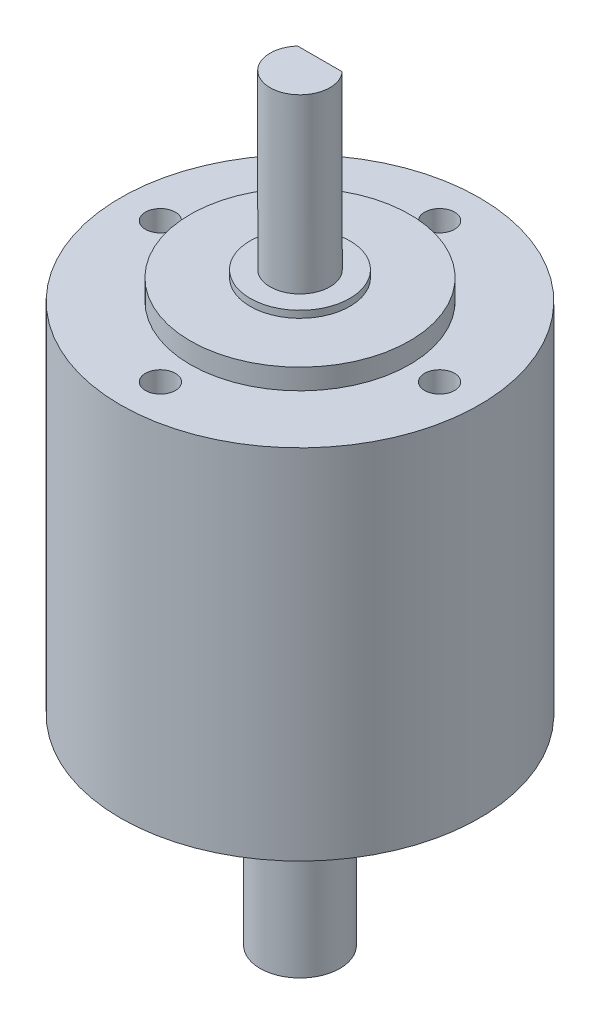
ISO-10303-21;
HEADER;
FILE_DESCRIPTION(('STEP AP214'),'2;1');
FILE_NAME('part.step','',(''),(''),'','','');
FILE_SCHEMA(('AUTOMOTIVE_DESIGN { 1 0 10303 214 1 1 1 1 }'));
ENDSEC;
DATA;
#1=APPLICATION_CONTEXT('core data for automotive mechanical design processes');
#2=APPLICATION_PROTOCOL_DEFINITION('international standard','automotive_design',2000,#1);
#3=PRODUCT_CONTEXT('',#1,'mechanical');
#4=PRODUCT('Part','Part','',(#3));
#5=PRODUCT_RELATED_PRODUCT_CATEGORY('part','',(#4));
#6=PRODUCT_DEFINITION_FORMATION('','',#4);
#7=PRODUCT_DEFINITION_CONTEXT('part definition',#1,'design');
#8=PRODUCT_DEFINITION('design','',#6,#7);
#9=PRODUCT_DEFINITION_SHAPE('','',#8);
#10=(LENGTH_UNIT() NAMED_UNIT(*) SI_UNIT(.MILLI.,.METRE.));
#11=(NAMED_UNIT(*) PLANE_ANGLE_UNIT() SI_UNIT($,.RADIAN.));
#12=(NAMED_UNIT(*) SI_UNIT($,.STERADIAN.) SOLID_ANGLE_UNIT());
#13=UNCERTAINTY_MEASURE_WITH_UNIT(LENGTH_MEASURE(1.E-05),#10,'distance_accuracy_value','');
#14=(GEOMETRIC_REPRESENTATION_CONTEXT(3) GLOBAL_UNCERTAINTY_ASSIGNED_CONTEXT((#13)) GLOBAL_UNIT_ASSIGNED_CONTEXT((#10,
#11,#12)) REPRESENTATION_CONTEXT('',''));
#15=CARTESIAN_POINT('',(0.,0.,0.));
#16=DIRECTION('',(0.,0.,1.));
#17=DIRECTION('',(1.,0.,0.));
#18=AXIS2_PLACEMENT_3D('',#15,#16,#17);
#19=CARTESIAN_POINT('',(0.,17.9451,0.));
#20=DIRECTION('',(0.,-1.,0.));
#21=DIRECTION('',(0.,0.,-1.));
#22=AXIS2_PLACEMENT_3D('',#19,#20,#21);
#23=CYLINDRICAL_SURFACE('',#22,18.);
#24=CARTESIAN_POINT('',(0.,17.9451,0.));
#25=DIRECTION('',(0.,1.,0.));
#26=DIRECTION('',(0.,0.,1.));
#27=AXIS2_PLACEMENT_3D('',#24,#25,#26);
#28=CIRCLE('',#27,18.);
#29=CARTESIAN_POINT('',(0.,17.9451,18.));
#30=VERTEX_POINT('',#29);
#31=EDGE_CURVE('E175',#30,#30,#28,.T.);
#32=ORIENTED_EDGE('',*,*,#31,.F.);
#33=EDGE_LOOP('',(#32));
#34=FACE_BOUND('',#33,.T.);
#35=CARTESIAN_POINT('',(0.,-17.9451,0.));
#36=DIRECTION('',(0.,1.,0.));
#37=DIRECTION('',(0.,0.,1.));
#38=AXIS2_PLACEMENT_3D('',#35,#36,#37);
#39=CIRCLE('',#38,18.);
#40=CARTESIAN_POINT('',(0.,-17.9451,18.));
#41=VERTEX_POINT('',#40);
#42=EDGE_CURVE('E174',#41,#41,#39,.T.);
#43=ORIENTED_EDGE('',*,*,#42,.T.);
#44=EDGE_LOOP('',(#43));
#45=FACE_BOUND('',#44,.T.);
#46=ADVANCED_FACE('F39',(#34,#45),#23,.T.);
#47=CARTESIAN_POINT('',(0.,17.9451,0.));
#48=DIRECTION('',(0.,1.,0.));
#49=DIRECTION('',(0.,0.,1.));
#50=AXIS2_PLACEMENT_3D('',#47,#48,#49);
#51=PLANE('',#50);
#52=CARTESIAN_POINT('',(0.,17.9451,-14.));
#53=DIRECTION('',(0.,1.,0.));
#54=DIRECTION('',(0.,0.,1.));
#55=AXIS2_PLACEMENT_3D('',#52,#53,#54);
#56=CIRCLE('',#55,1.5);
#57=CARTESIAN_POINT('',(0.,17.9451,-12.5));
#58=VERTEX_POINT('',#57);
#59=EDGE_CURVE('E132',#58,#58,#56,.T.);
#60=ORIENTED_EDGE('',*,*,#59,.F.);
#61=EDGE_LOOP('',(#60));
#62=FACE_BOUND('',#61,.T.);
#63=CARTESIAN_POINT('',(-14.,17.9451,0.));
#64=DIRECTION('',(0.,1.,0.));
#65=DIRECTION('',(0.,0.,1.));
#66=AXIS2_PLACEMENT_3D('',#63,#64,#65);
#67=CIRCLE('',#66,1.5);
#68=CARTESIAN_POINT('',(-14.,17.9451,1.5));
#69=VERTEX_POINT('',#68);
#70=EDGE_CURVE('E138',#69,#69,#67,.T.);
#71=ORIENTED_EDGE('',*,*,#70,.F.);
#72=EDGE_LOOP('',(#71));
#73=FACE_BOUND('',#72,.T.);
#74=CARTESIAN_POINT('',(0.,17.9451,14.));
#75=DIRECTION('',(0.,1.,0.));
#76=DIRECTION('',(0.,0.,1.));
#77=AXIS2_PLACEMENT_3D('',#74,#75,#76);
#78=CIRCLE('',#77,1.5);
#79=CARTESIAN_POINT('',(0.,17.9451,15.5));
#80=VERTEX_POINT('',#79);
#81=EDGE_CURVE('E144',#80,#80,#78,.T.);
#82=ORIENTED_EDGE('',*,*,#81,.F.);
#83=EDGE_LOOP('',(#82));
#84=FACE_BOUND('',#83,.T.);
#85=CARTESIAN_POINT('',(14.,17.9451,0.));
#86=DIRECTION('',(0.,1.,0.));
#87=DIRECTION('',(0.,0.,1.));
#88=AXIS2_PLACEMENT_3D('',#85,#86,#87);
#89=CIRCLE('',#88,1.5);
#90=CARTESIAN_POINT('',(14.,17.9451,1.5));
#91=VERTEX_POINT('',#90);
#92=EDGE_CURVE('E107',#91,#91,#89,.T.);
#93=ORIENTED_EDGE('',*,*,#92,.F.);
#94=EDGE_LOOP('',(#93));
#95=FACE_BOUND('',#94,.T.);
#96=CARTESIAN_POINT('',(0.,17.9451,0.));
#97=DIRECTION('',(0.,1.,0.));
#98=DIRECTION('',(0.,0.,1.));
#99=AXIS2_PLACEMENT_3D('',#96,#97,#98);
#100=CIRCLE('',#99,11.);
#101=CARTESIAN_POINT('',(0.,17.9451,11.));
#102=VERTEX_POINT('',#101);
#103=EDGE_CURVE('E169',#102,#102,#100,.F.);
#104=ORIENTED_EDGE('',*,*,#103,.T.);
#105=EDGE_LOOP('',(#104));
#106=FACE_BOUND('',#105,.T.);
#107=ORIENTED_EDGE('',*,*,#31,.T.);
#108=EDGE_LOOP('',(#107));
#109=FACE_BOUND('',#108,.T.);
#110=ADVANCED_FACE('F218',(#62,#73,#84,#95,#106,#109),#51,.T.);
#111=CARTESIAN_POINT('',(0.,-17.9451,0.));
#112=DIRECTION('',(0.,1.,0.));
#113=DIRECTION('',(0.,0.,1.));
#114=AXIS2_PLACEMENT_3D('',#111,#112,#113);
#115=PLANE('',#114);
#116=CARTESIAN_POINT('',(0.,-17.9451,-14.));
#117=DIRECTION('',(0.,1.,0.));
#118=DIRECTION('',(0.,0.,1.));
#119=AXIS2_PLACEMENT_3D('',#116,#117,#118);
#120=CIRCLE('',#119,1.5);
#121=CARTESIAN_POINT('',(0.,-17.9451,-12.5));
#122=VERTEX_POINT('',#121);
#123=EDGE_CURVE('E108',#122,#122,#120,.T.);
#124=ORIENTED_EDGE('',*,*,#123,.T.);
#125=EDGE_LOOP('',(#124));
#126=FACE_BOUND('',#125,.T.);
#127=CARTESIAN_POINT('',(-14.,-17.9451,0.));
#128=DIRECTION('',(0.,1.,0.));
#129=DIRECTION('',(0.,0.,1.));
#130=AXIS2_PLACEMENT_3D('',#127,#128,#129);
#131=CIRCLE('',#130,1.5);
#132=CARTESIAN_POINT('',(-14.,-17.9451,1.5));
#133=VERTEX_POINT('',#132);
#134=EDGE_CURVE('E114',#133,#133,#131,.T.);
#135=ORIENTED_EDGE('',*,*,#134,.T.);
#136=EDGE_LOOP('',(#135));
#137=FACE_BOUND('',#136,.T.);
#138=CARTESIAN_POINT('',(0.,-17.9451,14.));
#139=DIRECTION('',(0.,1.,0.));
#140=DIRECTION('',(0.,0.,1.));
#141=AXIS2_PLACEMENT_3D('',#138,#139,#140);
#142=CIRCLE('',#141,1.5);
#143=CARTESIAN_POINT('',(0.,-17.9451,15.5));
#144=VERTEX_POINT('',#143);
#145=EDGE_CURVE('E120',#144,#144,#142,.T.);
#146=ORIENTED_EDGE('',*,*,#145,.T.);
#147=EDGE_LOOP('',(#146));
#148=FACE_BOUND('',#147,.T.);
#149=CARTESIAN_POINT('',(14.,-17.9451,0.));
#150=DIRECTION('',(0.,1.,0.));
#151=DIRECTION('',(0.,0.,1.));
#152=AXIS2_PLACEMENT_3D('',#149,#150,#151);
#153=CIRCLE('',#152,1.5);
#154=CARTESIAN_POINT('',(14.,-17.9451,1.5));
#155=VERTEX_POINT('',#154);
#156=EDGE_CURVE('E103',#155,#155,#153,.T.);
#157=ORIENTED_EDGE('',*,*,#156,.T.);
#158=EDGE_LOOP('',(#157));
#159=FACE_BOUND('',#158,.T.);
#160=CARTESIAN_POINT('',(0.,-17.9451,0.));
#161=DIRECTION('',(0.,1.,0.));
#162=DIRECTION('',(0.,0.,1.));
#163=AXIS2_PLACEMENT_3D('',#160,#161,#162);
#164=CIRCLE('',#163,11.);
#165=CARTESIAN_POINT('',(0.,-17.9451,11.));
#166=VERTEX_POINT('',#165);
#167=EDGE_CURVE('E178',#166,#166,#164,.F.);
#168=ORIENTED_EDGE('',*,*,#167,.F.);
#169=EDGE_LOOP('',(#168));
#170=FACE_BOUND('',#169,.T.);
#171=ORIENTED_EDGE('',*,*,#42,.F.);
#172=EDGE_LOOP('',(#171));
#173=FACE_BOUND('',#172,.T.);
#174=ADVANCED_FACE('F223',(#126,#137,#148,#159,#170,#173),#115,.F.);
#175=CARTESIAN_POINT('',(0.,-20.0025,0.));
#176=DIRECTION('',(0.,1.,0.));
#177=DIRECTION('',(0.,0.,1.));
#178=AXIS2_PLACEMENT_3D('',#175,#176,#177);
#179=PLANE('',#178);
#180=CARTESIAN_POINT('',(0.,-20.0025,0.));
#181=DIRECTION('',(0.,1.,0.));
#182=DIRECTION('',(0.,0.,1.));
#183=AXIS2_PLACEMENT_3D('',#180,#181,#182);
#184=CIRCLE('',#183,5.);
#185=CARTESIAN_POINT('',(0.,-20.0025,5.));
#186=VERTEX_POINT('',#185);
#187=EDGE_CURVE('E13',#186,#186,#184,.F.);
#188=ORIENTED_EDGE('',*,*,#187,.F.);
#189=EDGE_LOOP('',(#188));
#190=FACE_BOUND('',#189,.T.);
#191=CARTESIAN_POINT('',(0.,-20.0025,0.));
#192=DIRECTION('',(0.,1.,0.));
#193=DIRECTION('',(0.,0.,1.));
#194=AXIS2_PLACEMENT_3D('',#191,#192,#193);
#195=CIRCLE('',#194,11.);
#196=CARTESIAN_POINT('',(0.,-20.0025,11.));
#197=VERTEX_POINT('',#196);
#198=EDGE_CURVE('E165',#197,#197,#195,.T.);
#199=ORIENTED_EDGE('',*,*,#198,.F.);
#200=EDGE_LOOP('',(#199));
#201=FACE_BOUND('',#200,.T.);
#202=ADVANCED_FACE('F231',(#190,#201),#179,.F.);
#203=CARTESIAN_POINT('',(0.,20.0025,0.));
#204=DIRECTION('',(0.,-1.,0.));
#205=DIRECTION('',(0.,0.,-1.));
#206=AXIS2_PLACEMENT_3D('',#203,#204,#205);
#207=CYLINDRICAL_SURFACE('',#206,11.);
#208=ORIENTED_EDGE('',*,*,#198,.T.);
#209=EDGE_LOOP('',(#208));
#210=FACE_BOUND('',#209,.T.);
#211=ORIENTED_EDGE('',*,*,#167,.T.);
#212=EDGE_LOOP('',(#211));
#213=FACE_BOUND('',#212,.T.);
#214=ADVANCED_FACE('F236',(#210,#213),#207,.T.);
#215=ORIENTED_EDGE('',*,*,#103,.F.);
#216=EDGE_LOOP('',(#215));
#217=FACE_BOUND('',#216,.T.);
#218=CARTESIAN_POINT('',(0.,20.0025,0.));
#219=DIRECTION('',(0.,1.,0.));
#220=DIRECTION('',(0.,0.,1.));
#221=AXIS2_PLACEMENT_3D('',#218,#219,#220);
#222=CIRCLE('',#221,11.);
#223=CARTESIAN_POINT('',(0.,20.0025,11.));
#224=VERTEX_POINT('',#223);
#225=EDGE_CURVE('E166',#224,#224,#222,.T.);
#226=ORIENTED_EDGE('',*,*,#225,.F.);
#227=EDGE_LOOP('',(#226));
#228=FACE_BOUND('',#227,.T.);
#229=ADVANCED_FACE('F241',(#217,#228),#207,.T.);
#230=CARTESIAN_POINT('',(0.,20.0025,0.));
#231=DIRECTION('',(0.,1.,0.));
#232=DIRECTION('',(0.,0.,1.));
#233=AXIS2_PLACEMENT_3D('',#230,#231,#232);
#234=PLANE('',#233);
#235=CARTESIAN_POINT('',(0.,20.0025,0.));
#236=DIRECTION('',(0.,1.,0.));
#237=DIRECTION('',(0.,0.,1.));
#238=AXIS2_PLACEMENT_3D('',#235,#236,#237);
#239=CIRCLE('',#238,5.);
#240=CARTESIAN_POINT('',(0.,20.0025,5.));
#241=VERTEX_POINT('',#240);
#242=EDGE_CURVE('E42',#241,#241,#239,.F.);
#243=ORIENTED_EDGE('',*,*,#242,.T.);
#244=EDGE_LOOP('',(#243));
#245=FACE_BOUND('',#244,.T.);
#246=ORIENTED_EDGE('',*,*,#225,.T.);
#247=EDGE_LOOP('',(#246));
#248=FACE_BOUND('',#247,.T.);
#249=ADVANCED_FACE('F243',(#245,#248),#234,.T.);
#250=CARTESIAN_POINT('',(14.,13.9451,0.));
#251=DIRECTION('',(0.,1.,0.));
#252=DIRECTION('',(0.,0.,1.));
#253=AXIS2_PLACEMENT_3D('',#250,#251,#252);
#254=CYLINDRICAL_SURFACE('',#253,1.5);
#255=CARTESIAN_POINT('',(14.,13.9451,0.));
#256=DIRECTION('',(0.,1.,0.));
#257=DIRECTION('',(0.,0.,1.));
#258=AXIS2_PLACEMENT_3D('',#255,#256,#257);
#259=CIRCLE('',#258,1.5);
#260=CARTESIAN_POINT('',(14.,13.9451,1.5));
#261=VERTEX_POINT('',#260);
#262=EDGE_CURVE('E147',#261,#261,#259,.T.);
#263=ORIENTED_EDGE('',*,*,#262,.F.);
#264=EDGE_LOOP('',(#263));
#265=FACE_BOUND('',#264,.T.);
#266=ORIENTED_EDGE('',*,*,#92,.T.);
#267=EDGE_LOOP('',(#266));
#268=FACE_BOUND('',#267,.T.);
#269=ADVANCED_FACE('F248',(#265,#268),#254,.F.);
#270=CARTESIAN_POINT('',(14.,13.9451,0.));
#271=DIRECTION('',(0.,1.,0.));
#272=DIRECTION('',(0.,0.,1.));
#273=AXIS2_PLACEMENT_3D('',#270,#271,#272);
#274=PLANE('',#273);
#275=ORIENTED_EDGE('',*,*,#262,.T.);
#276=EDGE_LOOP('',(#275));
#277=FACE_BOUND('',#276,.T.);
#278=ADVANCED_FACE('F267',(#277),#274,.T.);
#279=CARTESIAN_POINT('',(0.,13.9451,14.));
#280=DIRECTION('',(0.,1.,0.));
#281=DIRECTION('',(0.,0.,1.));
#282=AXIS2_PLACEMENT_3D('',#279,#280,#281);
#283=CYLINDRICAL_SURFACE('',#282,1.5);
#284=CARTESIAN_POINT('',(0.,13.9451,14.));
#285=DIRECTION('',(0.,1.,0.));
#286=DIRECTION('',(0.,0.,1.));
#287=AXIS2_PLACEMENT_3D('',#284,#285,#286);
#288=CIRCLE('',#287,1.5);
#289=CARTESIAN_POINT('',(0.,13.9451,15.5));
#290=VERTEX_POINT('',#289);
#291=EDGE_CURVE('E141',#290,#290,#288,.T.);
#292=ORIENTED_EDGE('',*,*,#291,.F.);
#293=EDGE_LOOP('',(#292));
#294=FACE_BOUND('',#293,.T.);
#295=ORIENTED_EDGE('',*,*,#81,.T.);
#296=EDGE_LOOP('',(#295));
#297=FACE_BOUND('',#296,.T.);
#298=ADVANCED_FACE('F271',(#294,#297),#283,.F.);
#299=CARTESIAN_POINT('',(0.,13.9451,14.));
#300=DIRECTION('',(0.,1.,0.));
#301=DIRECTION('',(0.,0.,1.));
#302=AXIS2_PLACEMENT_3D('',#299,#300,#301);
#303=PLANE('',#302);
#304=ORIENTED_EDGE('',*,*,#291,.T.);
#305=EDGE_LOOP('',(#304));
#306=FACE_BOUND('',#305,.T.);
#307=ADVANCED_FACE('F275',(#306),#303,.T.);
#308=CARTESIAN_POINT('',(-14.,13.9451,0.));
#309=DIRECTION('',(0.,1.,0.));
#310=DIRECTION('',(0.,0.,1.));
#311=AXIS2_PLACEMENT_3D('',#308,#309,#310);
#312=CYLINDRICAL_SURFACE('',#311,1.5);
#313=CARTESIAN_POINT('',(-14.,13.9451,0.));
#314=DIRECTION('',(0.,1.,0.));
#315=DIRECTION('',(0.,0.,1.));
#316=AXIS2_PLACEMENT_3D('',#313,#314,#315);
#317=CIRCLE('',#316,1.5);
#318=CARTESIAN_POINT('',(-14.,13.9451,1.5));
#319=VERTEX_POINT('',#318);
#320=EDGE_CURVE('E135',#319,#319,#317,.T.);
#321=ORIENTED_EDGE('',*,*,#320,.F.);
#322=EDGE_LOOP('',(#321));
#323=FACE_BOUND('',#322,.T.);
#324=ORIENTED_EDGE('',*,*,#70,.T.);
#325=EDGE_LOOP('',(#324));
#326=FACE_BOUND('',#325,.T.);
#327=ADVANCED_FACE('F279',(#323,#326),#312,.F.);
#328=CARTESIAN_POINT('',(-14.,13.9451,0.));
#329=DIRECTION('',(0.,1.,0.));
#330=DIRECTION('',(0.,0.,1.));
#331=AXIS2_PLACEMENT_3D('',#328,#329,#330);
#332=PLANE('',#331);
#333=ORIENTED_EDGE('',*,*,#320,.T.);
#334=EDGE_LOOP('',(#333));
#335=FACE_BOUND('',#334,.T.);
#336=ADVANCED_FACE('F283',(#335),#332,.T.);
#337=CARTESIAN_POINT('',(0.,13.9451,-14.));
#338=DIRECTION('',(0.,1.,0.));
#339=DIRECTION('',(0.,0.,1.));
#340=AXIS2_PLACEMENT_3D('',#337,#338,#339);
#341=CYLINDRICAL_SURFACE('',#340,1.5);
#342=CARTESIAN_POINT('',(0.,13.9451,-14.));
#343=DIRECTION('',(0.,1.,0.));
#344=DIRECTION('',(0.,0.,1.));
#345=AXIS2_PLACEMENT_3D('',#342,#343,#344);
#346=CIRCLE('',#345,1.5);
#347=CARTESIAN_POINT('',(0.,13.9451,-12.5));
#348=VERTEX_POINT('',#347);
#349=EDGE_CURVE('E128',#348,#348,#346,.T.);
#350=ORIENTED_EDGE('',*,*,#349,.F.);
#351=EDGE_LOOP('',(#350));
#352=FACE_BOUND('',#351,.T.);
#353=ORIENTED_EDGE('',*,*,#59,.T.);
#354=EDGE_LOOP('',(#353));
#355=FACE_BOUND('',#354,.T.);
#356=ADVANCED_FACE('F287',(#352,#355),#341,.F.);
#357=CARTESIAN_POINT('',(0.,13.9451,-14.));
#358=DIRECTION('',(0.,1.,0.));
#359=DIRECTION('',(0.,0.,1.));
#360=AXIS2_PLACEMENT_3D('',#357,#358,#359);
#361=PLANE('',#360);
#362=ORIENTED_EDGE('',*,*,#349,.T.);
#363=EDGE_LOOP('',(#362));
#364=FACE_BOUND('',#363,.T.);
#365=ADVANCED_FACE('F291',(#364),#361,.T.);
#366=CARTESIAN_POINT('',(14.,-13.9451,0.));
#367=DIRECTION('',(0.,-1.,0.));
#368=DIRECTION('',(0.,0.,-1.));
#369=AXIS2_PLACEMENT_3D('',#366,#367,#368);
#370=CYLINDRICAL_SURFACE('',#369,1.5);
#371=CARTESIAN_POINT('',(14.,-13.9451,0.));
#372=DIRECTION('',(0.,1.,0.));
#373=DIRECTION('',(0.,0.,1.));
#374=AXIS2_PLACEMENT_3D('',#371,#372,#373);
#375=CIRCLE('',#374,1.5);
#376=CARTESIAN_POINT('',(14.,-13.9451,1.5));
#377=VERTEX_POINT('',#376);
#378=EDGE_CURVE('E123',#377,#377,#375,.T.);
#379=ORIENTED_EDGE('',*,*,#378,.T.);
#380=EDGE_LOOP('',(#379));
#381=FACE_BOUND('',#380,.T.);
#382=ORIENTED_EDGE('',*,*,#156,.F.);
#383=EDGE_LOOP('',(#382));
#384=FACE_BOUND('',#383,.T.);
#385=ADVANCED_FACE('F295',(#381,#384),#370,.F.);
#386=CARTESIAN_POINT('',(14.,-13.9451,0.));
#387=DIRECTION('',(0.,-1.,0.));
#388=DIRECTION('',(0.,0.,1.));
#389=AXIS2_PLACEMENT_3D('',#386,#387,#388);
#390=PLANE('',#389);
#391=ORIENTED_EDGE('',*,*,#378,.F.);
#392=EDGE_LOOP('',(#391));
#393=FACE_BOUND('',#392,.T.);
#394=ADVANCED_FACE('F299',(#393),#390,.T.);
#395=CARTESIAN_POINT('',(0.,-13.9451,14.));
#396=DIRECTION('',(0.,-1.,0.));
#397=DIRECTION('',(0.,0.,-1.));
#398=AXIS2_PLACEMENT_3D('',#395,#396,#397);
#399=CYLINDRICAL_SURFACE('',#398,1.5);
#400=CARTESIAN_POINT('',(0.,-13.9451,14.));
#401=DIRECTION('',(0.,1.,0.));
#402=DIRECTION('',(0.,0.,1.));
#403=AXIS2_PLACEMENT_3D('',#400,#401,#402);
#404=CIRCLE('',#403,1.5);
#405=CARTESIAN_POINT('',(0.,-13.9451,15.5));
#406=VERTEX_POINT('',#405);
#407=EDGE_CURVE('E117',#406,#406,#404,.T.);
#408=ORIENTED_EDGE('',*,*,#407,.T.);
#409=EDGE_LOOP('',(#408));
#410=FACE_BOUND('',#409,.T.);
#411=ORIENTED_EDGE('',*,*,#145,.F.);
#412=EDGE_LOOP('',(#411));
#413=FACE_BOUND('',#412,.T.);
#414=ADVANCED_FACE('F303',(#410,#413),#399,.F.);
#415=CARTESIAN_POINT('',(0.,-13.9451,14.));
#416=DIRECTION('',(0.,-1.,0.));
#417=DIRECTION('',(0.,0.,1.));
#418=AXIS2_PLACEMENT_3D('',#415,#416,#417);
#419=PLANE('',#418);
#420=ORIENTED_EDGE('',*,*,#407,.F.);
#421=EDGE_LOOP('',(#420));
#422=FACE_BOUND('',#421,.T.);
#423=ADVANCED_FACE('F307',(#422),#419,.T.);
#424=CARTESIAN_POINT('',(-14.,-13.9451,0.));
#425=DIRECTION('',(0.,-1.,0.));
#426=DIRECTION('',(0.,0.,-1.));
#427=AXIS2_PLACEMENT_3D('',#424,#425,#426);
#428=CYLINDRICAL_SURFACE('',#427,1.5);
#429=CARTESIAN_POINT('',(-14.,-13.9451,0.));
#430=DIRECTION('',(0.,1.,0.));
#431=DIRECTION('',(0.,0.,1.));
#432=AXIS2_PLACEMENT_3D('',#429,#430,#431);
#433=CIRCLE('',#432,1.5);
#434=CARTESIAN_POINT('',(-14.,-13.9451,1.5));
#435=VERTEX_POINT('',#434);
#436=EDGE_CURVE('E111',#435,#435,#433,.T.);
#437=ORIENTED_EDGE('',*,*,#436,.T.);
#438=EDGE_LOOP('',(#437));
#439=FACE_BOUND('',#438,.T.);
#440=ORIENTED_EDGE('',*,*,#134,.F.);
#441=EDGE_LOOP('',(#440));
#442=FACE_BOUND('',#441,.T.);
#443=ADVANCED_FACE('F311',(#439,#442),#428,.F.);
#444=CARTESIAN_POINT('',(-14.,-13.9451,0.));
#445=DIRECTION('',(0.,-1.,0.));
#446=DIRECTION('',(0.,0.,1.));
#447=AXIS2_PLACEMENT_3D('',#444,#445,#446);
#448=PLANE('',#447);
#449=ORIENTED_EDGE('',*,*,#436,.F.);
#450=EDGE_LOOP('',(#449));
#451=FACE_BOUND('',#450,.T.);
#452=ADVANCED_FACE('F315',(#451),#448,.T.);
#453=CARTESIAN_POINT('',(0.,-13.9451,-14.));
#454=DIRECTION('',(0.,-1.,0.));
#455=DIRECTION('',(0.,0.,-1.));
#456=AXIS2_PLACEMENT_3D('',#453,#454,#455);
#457=CYLINDRICAL_SURFACE('',#456,1.5);
#458=CARTESIAN_POINT('',(0.,-13.9451,-14.));
#459=DIRECTION('',(0.,1.,0.));
#460=DIRECTION('',(0.,0.,1.));
#461=AXIS2_PLACEMENT_3D('',#458,#459,#460);
#462=CIRCLE('',#461,1.5);
#463=CARTESIAN_POINT('',(0.,-13.9451,-12.5));
#464=VERTEX_POINT('',#463);
#465=EDGE_CURVE('E104',#464,#464,#462,.T.);
#466=ORIENTED_EDGE('',*,*,#465,.T.);
#467=EDGE_LOOP('',(#466));
#468=FACE_BOUND('',#467,.T.);
#469=ORIENTED_EDGE('',*,*,#123,.F.);
#470=EDGE_LOOP('',(#469));
#471=FACE_BOUND('',#470,.T.);
#472=ADVANCED_FACE('F213',(#468,#471),#457,.F.);
#473=CARTESIAN_POINT('',(0.,-13.9451,-14.));
#474=DIRECTION('',(0.,-1.,0.));
#475=DIRECTION('',(0.,0.,1.));
#476=AXIS2_PLACEMENT_3D('',#473,#474,#475);
#477=PLANE('',#476);
#478=ORIENTED_EDGE('',*,*,#465,.F.);
#479=EDGE_LOOP('',(#478));
#480=FACE_BOUND('',#479,.T.);
#481=ADVANCED_FACE('F204',(#480),#477,.T.);
#482=CARTESIAN_POINT('',(0.,-20.701,0.));
#483=DIRECTION('',(0.,1.,0.));
#484=DIRECTION('',(0.,0.,1.));
#485=AXIS2_PLACEMENT_3D('',#482,#483,#484);
#486=PLANE('',#485);
#487=CARTESIAN_POINT('',(0.,-20.701,0.));
#488=DIRECTION('',(0.,1.,0.));
#489=DIRECTION('',(0.,0.,1.));
#490=AXIS2_PLACEMENT_3D('',#487,#488,#489);
#491=CIRCLE('',#490,4.);
#492=CARTESIAN_POINT('',(0.,-20.701,4.));
#493=VERTEX_POINT('',#492);
#494=EDGE_CURVE('E47',#493,#493,#491,.T.);
#495=ORIENTED_EDGE('',*,*,#494,.T.);
#496=EDGE_LOOP('',(#495));
#497=FACE_BOUND('',#496,.T.);
#498=CARTESIAN_POINT('',(0.,-20.701,0.));
#499=DIRECTION('',(0.,1.,0.));
#500=DIRECTION('',(0.,0.,1.));
#501=AXIS2_PLACEMENT_3D('',#498,#499,#500);
#502=CIRCLE('',#501,5.);
#503=CARTESIAN_POINT('',(0.,-20.701,5.));
#504=VERTEX_POINT('',#503);
#505=EDGE_CURVE('E191',#504,#504,#502,.T.);
#506=ORIENTED_EDGE('',*,*,#505,.F.);
#507=EDGE_LOOP('',(#506));
#508=FACE_BOUND('',#507,.T.);
#509=ADVANCED_FACE('F202',(#497,#508),#486,.F.);
#510=CARTESIAN_POINT('',(0.,20.701,0.));
#511=DIRECTION('',(0.,-1.,0.));
#512=DIRECTION('',(0.,0.,-1.));
#513=AXIS2_PLACEMENT_3D('',#510,#511,#512);
#514=CYLINDRICAL_SURFACE('',#513,5.);
#515=ORIENTED_EDGE('',*,*,#505,.T.);
#516=EDGE_LOOP('',(#515));
#517=FACE_BOUND('',#516,.T.);
#518=ORIENTED_EDGE('',*,*,#187,.T.);
#519=EDGE_LOOP('',(#518));
#520=FACE_BOUND('',#519,.T.);
#521=ADVANCED_FACE('F199',(#517,#520),#514,.T.);
#522=CARTESIAN_POINT('',(0.,-23.0025,0.));
#523=DIRECTION('',(0.,1.,0.));
#524=DIRECTION('',(0.,0.,1.));
#525=AXIS2_PLACEMENT_3D('',#522,#523,#524);
#526=PLANE('',#525);
#527=CARTESIAN_POINT('',(0.,-23.0025,0.));
#528=DIRECTION('',(0.,1.,0.));
#529=DIRECTION('',(0.,0.,1.));
#530=AXIS2_PLACEMENT_3D('',#527,#528,#529);
#531=CIRCLE('',#530,4.);
#532=CARTESIAN_POINT('',(-2.64575131106459,-23.0025,-3.));
#533=VERTEX_POINT('',#532);
#534=CARTESIAN_POINT('',(2.64575131106459,-23.0025,-3.));
#535=VERTEX_POINT('',#534);
#536=EDGE_CURVE('E90',#533,#535,#531,.F.);
#537=ORIENTED_EDGE('',*,*,#536,.T.);
#538=DIRECTION('',(-1.,0.,0.));
#539=VECTOR('',#538,1.);
#540=CARTESIAN_POINT('',(-2.64575131106459,-23.0025,-3.));
#541=LINE('',#540,#539);
#542=EDGE_CURVE('E83',#535,#533,#541,.T.);
#543=ORIENTED_EDGE('',*,*,#542,.T.);
#544=EDGE_LOOP('',(#537,#543));
#545=FACE_BOUND('',#544,.T.);
#546=ADVANCED_FACE('F93',(#545),#526,.F.);
#547=CARTESIAN_POINT('',(-2.64575131106459,-14.6173351928655,-3.));
#548=DIRECTION('',(0.,0.,1.));
#549=DIRECTION('',(1.,0.,0.));
#550=AXIS2_PLACEMENT_3D('',#547,#548,#549);
#551=PLANE('',#550);
#552=DIRECTION('',(0.,-1.,0.));
#553=VECTOR('',#552,1.);
#554=CARTESIAN_POINT('',(2.64575131106459,-14.6173351928655,-3.));
#555=LINE('',#554,#553);
#556=CARTESIAN_POINT('',(2.64575131106459,-38.0025,-3.));
#557=VERTEX_POINT('',#556);
#558=EDGE_CURVE('E55',#535,#557,#555,.T.);
#559=ORIENTED_EDGE('',*,*,#558,.T.);
#560=DIRECTION('',(-1.,0.,0.));
#561=VECTOR('',#560,1.);
#562=CARTESIAN_POINT('',(-2.64575131106459,-38.0025,-3.));
#563=LINE('',#562,#561);
#564=CARTESIAN_POINT('',(-2.64575131106459,-38.0025,-3.));
#565=VERTEX_POINT('',#564);
#566=EDGE_CURVE('E85',#557,#565,#563,.T.);
#567=ORIENTED_EDGE('',*,*,#566,.T.);
#568=DIRECTION('',(0.,-1.,0.));
#569=VECTOR('',#568,1.);
#570=CARTESIAN_POINT('',(-2.64575131106459,-14.6173351928655,-3.));
#571=LINE('',#570,#569);
#572=EDGE_CURVE('E80',#533,#565,#571,.T.);
#573=ORIENTED_EDGE('',*,*,#572,.F.);
#574=ORIENTED_EDGE('',*,*,#542,.F.);
#575=EDGE_LOOP('',(#559,#567,#573,#574));
#576=FACE_BOUND('',#575,.T.);
#577=ADVANCED_FACE('F82',(#576),#551,.F.);
#578=CARTESIAN_POINT('',(0.,-38.0025,0.));
#579=DIRECTION('',(0.,-1.,0.));
#580=DIRECTION('',(0.,0.,-1.));
#581=AXIS2_PLACEMENT_3D('',#578,#579,#580);
#582=PLANE('',#581);
#583=ORIENTED_EDGE('',*,*,#566,.F.);
#584=CARTESIAN_POINT('',(0.,-38.0025,0.));
#585=DIRECTION('',(0.,-1.,0.));
#586=DIRECTION('',(0.,0.,-1.));
#587=AXIS2_PLACEMENT_3D('',#584,#585,#586);
#588=CIRCLE('',#587,4.);
#589=EDGE_CURVE('E98',#557,#565,#588,.T.);
#590=ORIENTED_EDGE('',*,*,#589,.T.);
#591=EDGE_LOOP('',(#583,#590));
#592=FACE_BOUND('',#591,.T.);
#593=ADVANCED_FACE('F325',(#592),#582,.T.);
#594=CARTESIAN_POINT('',(0.,-38.0025,0.));
#595=DIRECTION('',(0.,1.,0.));
#596=DIRECTION('',(0.,0.,1.));
#597=AXIS2_PLACEMENT_3D('',#594,#595,#596);
#598=CYLINDRICAL_SURFACE('',#597,4.);
#599=ORIENTED_EDGE('',*,*,#589,.F.);
#600=ORIENTED_EDGE('',*,*,#558,.F.);
#601=ORIENTED_EDGE('',*,*,#536,.F.);
#602=ORIENTED_EDGE('',*,*,#572,.T.);
#603=EDGE_LOOP('',(#599,#600,#601,#602));
#604=FACE_BOUND('',#603,.T.);
#605=ORIENTED_EDGE('',*,*,#494,.F.);
#606=EDGE_LOOP('',(#605));
#607=FACE_BOUND('',#606,.T.);
#608=ADVANCED_FACE('F95',(#604,#607),#598,.T.);
#609=ORIENTED_EDGE('',*,*,#242,.F.);
#610=EDGE_LOOP('',(#609));
#611=FACE_BOUND('',#610,.T.);
#612=CARTESIAN_POINT('',(0.,20.701,0.));
#613=DIRECTION('',(0.,1.,0.));
#614=DIRECTION('',(0.,0.,1.));
#615=AXIS2_PLACEMENT_3D('',#612,#613,#614);
#616=CIRCLE('',#615,5.);
#617=CARTESIAN_POINT('',(0.,20.701,5.));
#618=VERTEX_POINT('',#617);
#619=EDGE_CURVE('E186',#618,#618,#616,.T.);
#620=ORIENTED_EDGE('',*,*,#619,.F.);
#621=EDGE_LOOP('',(#620));
#622=FACE_BOUND('',#621,.T.);
#623=ADVANCED_FACE('F212',(#611,#622),#514,.T.);
#624=CARTESIAN_POINT('',(0.,20.701,0.));
#625=DIRECTION('',(0.,1.,0.));
#626=DIRECTION('',(0.,0.,1.));
#627=AXIS2_PLACEMENT_3D('',#624,#625,#626);
#628=PLANE('',#627);
#629=CARTESIAN_POINT('',(0.,20.701,0.));
#630=DIRECTION('',(0.,1.,0.));
#631=DIRECTION('',(0.,0.,1.));
#632=AXIS2_PLACEMENT_3D('',#629,#630,#631);
#633=CIRCLE('',#632,3.);
#634=CARTESIAN_POINT('',(0.,20.701,3.));
#635=VERTEX_POINT('',#634);
#636=EDGE_CURVE('E184',#635,#635,#633,.T.);
#637=ORIENTED_EDGE('',*,*,#636,.F.);
#638=EDGE_LOOP('',(#637));
#639=FACE_BOUND('',#638,.T.);
#640=ORIENTED_EDGE('',*,*,#619,.T.);
#641=EDGE_LOOP('',(#640));
#642=FACE_BOUND('',#641,.T.);
#643=ADVANCED_FACE('F263',(#639,#642),#628,.T.);
#644=CARTESIAN_POINT('',(0.,23.0025,0.));
#645=DIRECTION('',(0.,1.,0.));
#646=DIRECTION('',(0.,0.,1.));
#647=AXIS2_PLACEMENT_3D('',#644,#645,#646);
#648=PLANE('',#647);
#649=CARTESIAN_POINT('',(0.,23.0025,0.));
#650=DIRECTION('',(0.,1.,0.));
#651=DIRECTION('',(0.,0.,1.));
#652=AXIS2_PLACEMENT_3D('',#649,#650,#651);
#653=CIRCLE('',#652,3.);
#654=CARTESIAN_POINT('',(2.23606797749979,23.0025,-2.));
#655=VERTEX_POINT('',#654);
#656=CARTESIAN_POINT('',(-2.23606797749979,23.0025,-2.));
#657=VERTEX_POINT('',#656);
#658=EDGE_CURVE('E152',#655,#657,#653,.T.);
#659=ORIENTED_EDGE('',*,*,#658,.T.);
#660=DIRECTION('',(1.,0.,0.));
#661=VECTOR('',#660,1.);
#662=CARTESIAN_POINT('',(-2.23606797749979,23.0025,-2.));
#663=LINE('',#662,#661);
#664=EDGE_CURVE('E154',#657,#655,#663,.T.);
#665=ORIENTED_EDGE('',*,*,#664,.T.);
#666=EDGE_LOOP('',(#659,#665));
#667=FACE_BOUND('',#666,.T.);
#668=ADVANCED_FACE('F260',(#667),#648,.T.);
#669=CARTESIAN_POINT('',(-2.23606797749979,23.0025,-2.));
#670=DIRECTION('',(0.,0.,1.));
#671=DIRECTION('',(1.,0.,0.));
#672=AXIS2_PLACEMENT_3D('',#669,#670,#671);
#673=PLANE('',#672);
#674=DIRECTION('',(1.,0.,0.));
#675=VECTOR('',#674,1.);
#676=CARTESIAN_POINT('',(-2.23606797749979,38.0025,-2.));
#677=LINE('',#676,#675);
#678=CARTESIAN_POINT('',(-2.23606797749979,38.0025,-2.));
#679=VERTEX_POINT('',#678);
#680=CARTESIAN_POINT('',(2.23606797749979,38.0025,-2.));
#681=VERTEX_POINT('',#680);
#682=EDGE_CURVE('E131',#679,#681,#677,.T.);
#683=ORIENTED_EDGE('',*,*,#682,.T.);
#684=DIRECTION('',(0.,1.,0.));
#685=VECTOR('',#684,1.);
#686=CARTESIAN_POINT('',(2.23606797749979,23.0025,-2.));
#687=LINE('',#686,#685);
#688=EDGE_CURVE('E158',#655,#681,#687,.T.);
#689=ORIENTED_EDGE('',*,*,#688,.F.);
#690=ORIENTED_EDGE('',*,*,#664,.F.);
#691=DIRECTION('',(0.,1.,0.));
#692=VECTOR('',#691,1.);
#693=CARTESIAN_POINT('',(-2.23606797749979,23.0025,-2.));
#694=LINE('',#693,#692);
#695=EDGE_CURVE('E63',#657,#679,#694,.T.);
#696=ORIENTED_EDGE('',*,*,#695,.T.);
#697=EDGE_LOOP('',(#683,#689,#690,#696));
#698=FACE_BOUND('',#697,.T.);
#699=ADVANCED_FACE('F256',(#698),#673,.F.);
#700=CARTESIAN_POINT('',(0.,38.0025,0.));
#701=DIRECTION('',(0.,1.,0.));
#702=DIRECTION('',(0.,0.,1.));
#703=AXIS2_PLACEMENT_3D('',#700,#701,#702);
#704=PLANE('',#703);
#705=ORIENTED_EDGE('',*,*,#682,.F.);
#706=CARTESIAN_POINT('',(0.,38.0025,0.));
#707=DIRECTION('',(0.,1.,0.));
#708=DIRECTION('',(0.,0.,1.));
#709=AXIS2_PLACEMENT_3D('',#706,#707,#708);
#710=CIRCLE('',#709,3.);
#711=EDGE_CURVE('E161',#679,#681,#710,.T.);
#712=ORIENTED_EDGE('',*,*,#711,.T.);
#713=EDGE_LOOP('',(#705,#712));
#714=FACE_BOUND('',#713,.T.);
#715=ADVANCED_FACE('F253',(#714),#704,.T.);
#716=CARTESIAN_POINT('',(0.,38.0025,0.));
#717=DIRECTION('',(0.,-1.,0.));
#718=DIRECTION('',(0.,0.,-1.));
#719=AXIS2_PLACEMENT_3D('',#716,#717,#718);
#720=CYLINDRICAL_SURFACE('',#719,3.);
#721=ORIENTED_EDGE('',*,*,#636,.T.);
#722=EDGE_LOOP('',(#721));
#723=FACE_BOUND('',#722,.T.);
#724=ORIENTED_EDGE('',*,*,#711,.F.);
#725=ORIENTED_EDGE('',*,*,#695,.F.);
#726=ORIENTED_EDGE('',*,*,#658,.F.);
#727=ORIENTED_EDGE('',*,*,#688,.T.);
#728=EDGE_LOOP('',(#724,#725,#726,#727));
#729=FACE_BOUND('',#728,.T.);
#730=ADVANCED_FACE('F250',(#723,#729),#720,.T.);
#731=CLOSED_SHELL('',(#46,#110,#174,#202,#214,#229,#249,#269,#278,#298,#307,#327,#336,#356,#365,
#385,#394,#414,#423,#443,#452,#472,#481,#509,#521,#546,#577,#593,#608,#623,#643,#668,#699,#715,#730));
#732=MANIFOLD_SOLID_BREP('B2',#731);
#733=ADVANCED_BREP_SHAPE_REPRESENTATION('',(#18,#732),#14);
#734=SHAPE_DEFINITION_REPRESENTATION(#9,#733);
ENDSEC;
END-ISO-10303-21;
